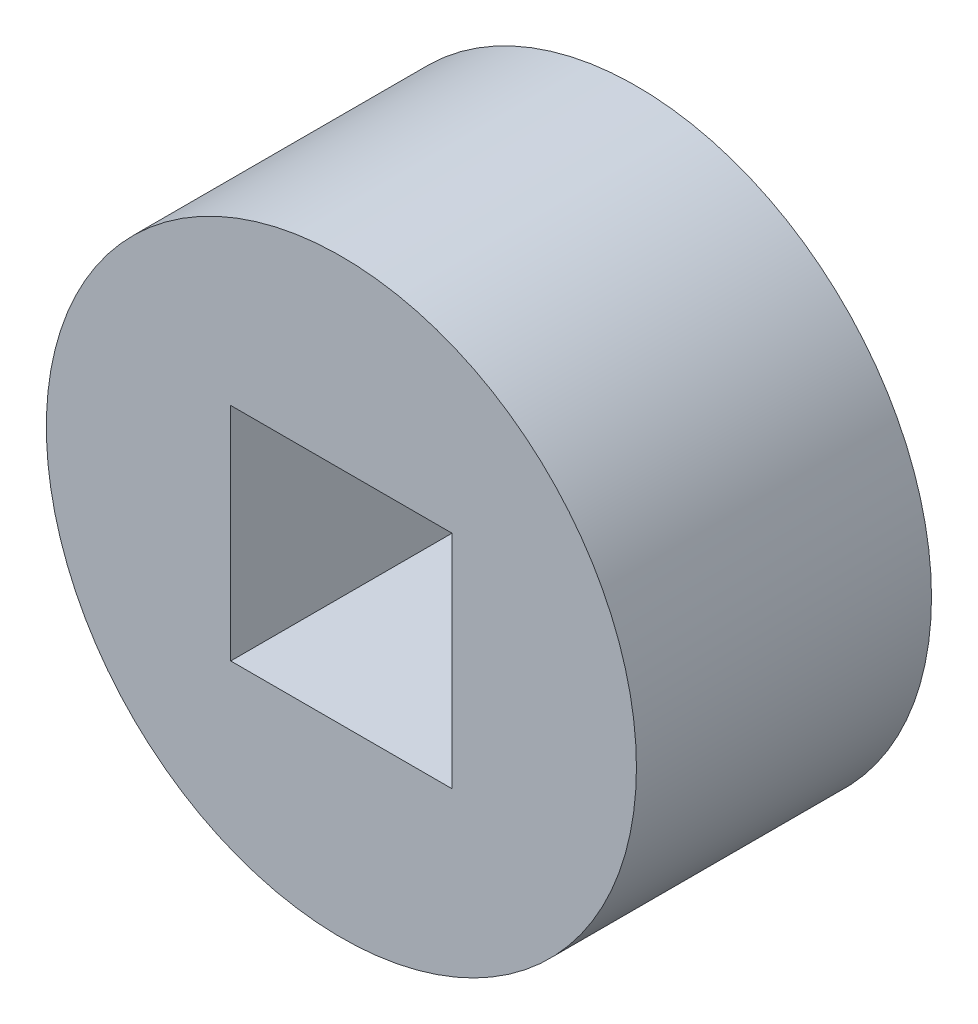
ISO-10303-21;
HEADER;
FILE_DESCRIPTION(('STEP AP214'),'2;1');
FILE_NAME('part.step','',(''),(''),'','','');
FILE_SCHEMA(('AUTOMOTIVE_DESIGN { 1 0 10303 214 1 1 1 1 }'));
ENDSEC;
DATA;
#1=APPLICATION_CONTEXT('core data for automotive mechanical design processes');
#2=APPLICATION_PROTOCOL_DEFINITION('international standard','automotive_design',2000,#1);
#3=PRODUCT_CONTEXT('',#1,'mechanical');
#4=PRODUCT('Part','Part','',(#3));
#5=PRODUCT_RELATED_PRODUCT_CATEGORY('part','',(#4));
#6=PRODUCT_DEFINITION_FORMATION('','',#4);
#7=PRODUCT_DEFINITION_CONTEXT('part definition',#1,'design');
#8=PRODUCT_DEFINITION('design','',#6,#7);
#9=PRODUCT_DEFINITION_SHAPE('','',#8);
#10=(LENGTH_UNIT() NAMED_UNIT(*) SI_UNIT(.MILLI.,.METRE.));
#11=(NAMED_UNIT(*) PLANE_ANGLE_UNIT() SI_UNIT($,.RADIAN.));
#12=(NAMED_UNIT(*) SI_UNIT($,.STERADIAN.) SOLID_ANGLE_UNIT());
#13=UNCERTAINTY_MEASURE_WITH_UNIT(LENGTH_MEASURE(1.E-05),#10,'distance_accuracy_value','');
#14=(GEOMETRIC_REPRESENTATION_CONTEXT(3) GLOBAL_UNCERTAINTY_ASSIGNED_CONTEXT((#13)) GLOBAL_UNIT_ASSIGNED_CONTEXT((#10,
#11,#12)) REPRESENTATION_CONTEXT('',''));
#15=CARTESIAN_POINT('',(0.,0.,0.));
#16=DIRECTION('',(0.,0.,1.));
#17=DIRECTION('',(1.,0.,0.));
#18=AXIS2_PLACEMENT_3D('',#15,#16,#17);
#19=CARTESIAN_POINT('',(0.,0.,4.));
#20=DIRECTION('',(0.,0.,1.));
#21=DIRECTION('',(1.,0.,0.));
#22=AXIS2_PLACEMENT_3D('',#19,#20,#21);
#23=PLANE('',#22);
#24=CARTESIAN_POINT('',(0.,0.,4.));
#25=DIRECTION('',(0.,0.,1.));
#26=DIRECTION('',(1.,0.,0.));
#27=AXIS2_PLACEMENT_3D('',#24,#25,#26);
#28=CIRCLE('',#27,4.);
#29=CARTESIAN_POINT('',(4.,0.,4.));
#30=VERTEX_POINT('',#29);
#31=EDGE_CURVE('E11',#30,#30,#28,.T.);
#32=ORIENTED_EDGE('',*,*,#31,.T.);
#33=EDGE_LOOP('',(#32));
#34=FACE_BOUND('',#33,.T.);
#35=DIRECTION('',(-1.,0.,0.));
#36=VECTOR('',#35,1.);
#37=CARTESIAN_POINT('',(-1.5,1.5,4.));
#38=LINE('',#37,#36);
#39=CARTESIAN_POINT('',(1.5,1.5,4.));
#40=VERTEX_POINT('',#39);
#41=CARTESIAN_POINT('',(-1.5,1.5,4.));
#42=VERTEX_POINT('',#41);
#43=EDGE_CURVE('E84',#40,#42,#38,.T.);
#44=ORIENTED_EDGE('',*,*,#43,.F.);
#45=DIRECTION('',(0.,1.,0.));
#46=VECTOR('',#45,1.);
#47=CARTESIAN_POINT('',(1.5,-1.5,4.));
#48=LINE('',#47,#46);
#49=CARTESIAN_POINT('',(1.5,-1.5,4.));
#50=VERTEX_POINT('',#49);
#51=EDGE_CURVE('E76',#50,#40,#48,.T.);
#52=ORIENTED_EDGE('',*,*,#51,.F.);
#53=DIRECTION('',(1.,0.,0.));
#54=VECTOR('',#53,1.);
#55=CARTESIAN_POINT('',(-1.5,-1.5,4.));
#56=LINE('',#55,#54);
#57=CARTESIAN_POINT('',(-1.5,-1.5,4.));
#58=VERTEX_POINT('',#57);
#59=EDGE_CURVE('E97',#58,#50,#56,.T.);
#60=ORIENTED_EDGE('',*,*,#59,.F.);
#61=DIRECTION('',(0.,-1.,0.));
#62=VECTOR('',#61,1.);
#63=CARTESIAN_POINT('',(-1.5,-1.5,4.));
#64=LINE('',#63,#62);
#65=EDGE_CURVE('E95',#42,#58,#64,.T.);
#66=ORIENTED_EDGE('',*,*,#65,.F.);
#67=EDGE_LOOP('',(#44,#52,#60,#66));
#68=FACE_BOUND('',#67,.T.);
#69=ADVANCED_FACE('F35',(#34,#68),#23,.T.);
#70=CARTESIAN_POINT('',(0.,0.,0.));
#71=DIRECTION('',(0.,0.,1.));
#72=DIRECTION('',(1.,0.,0.));
#73=AXIS2_PLACEMENT_3D('',#70,#71,#72);
#74=PLANE('',#73);
#75=CARTESIAN_POINT('',(0.,0.,0.));
#76=DIRECTION('',(0.,0.,1.));
#77=DIRECTION('',(1.,0.,0.));
#78=AXIS2_PLACEMENT_3D('',#75,#76,#77);
#79=CIRCLE('',#78,4.);
#80=CARTESIAN_POINT('',(4.,0.,0.));
#81=VERTEX_POINT('',#80);
#82=EDGE_CURVE('E39',#81,#81,#79,.T.);
#83=ORIENTED_EDGE('',*,*,#82,.F.);
#84=EDGE_LOOP('',(#83));
#85=FACE_BOUND('',#84,.T.);
#86=DIRECTION('',(0.,1.,0.));
#87=VECTOR('',#86,1.);
#88=CARTESIAN_POINT('',(1.5,-1.5,0.));
#89=LINE('',#88,#87);
#90=CARTESIAN_POINT('',(1.5,-1.5,0.));
#91=VERTEX_POINT('',#90);
#92=CARTESIAN_POINT('',(1.5,1.5,0.));
#93=VERTEX_POINT('',#92);
#94=EDGE_CURVE('E58',#91,#93,#89,.T.);
#95=ORIENTED_EDGE('',*,*,#94,.T.);
#96=DIRECTION('',(-1.,0.,0.));
#97=VECTOR('',#96,1.);
#98=CARTESIAN_POINT('',(-1.5,1.5,0.));
#99=LINE('',#98,#97);
#100=CARTESIAN_POINT('',(-1.5,1.5,0.));
#101=VERTEX_POINT('',#100);
#102=EDGE_CURVE('E91',#93,#101,#99,.T.);
#103=ORIENTED_EDGE('',*,*,#102,.T.);
#104=DIRECTION('',(0.,-1.,0.));
#105=VECTOR('',#104,1.);
#106=CARTESIAN_POINT('',(-1.5,-1.5,0.));
#107=LINE('',#106,#105);
#108=CARTESIAN_POINT('',(-1.5,-1.5,0.));
#109=VERTEX_POINT('',#108);
#110=EDGE_CURVE('E103',#101,#109,#107,.T.);
#111=ORIENTED_EDGE('',*,*,#110,.T.);
#112=DIRECTION('',(1.,0.,0.));
#113=VECTOR('',#112,1.);
#114=CARTESIAN_POINT('',(-1.5,-1.5,0.));
#115=LINE('',#114,#113);
#116=EDGE_CURVE('E85',#109,#91,#115,.T.);
#117=ORIENTED_EDGE('',*,*,#116,.T.);
#118=EDGE_LOOP('',(#95,#103,#111,#117));
#119=FACE_BOUND('',#118,.T.);
#120=ADVANCED_FACE('F114',(#85,#119),#74,.F.);
#121=CARTESIAN_POINT('',(0.,0.,4.));
#122=DIRECTION('',(0.,0.,-1.));
#123=DIRECTION('',(-1.,0.,0.));
#124=AXIS2_PLACEMENT_3D('',#121,#122,#123);
#125=CYLINDRICAL_SURFACE('',#124,4.);
#126=ORIENTED_EDGE('',*,*,#31,.F.);
#127=EDGE_LOOP('',(#126));
#128=FACE_BOUND('',#127,.T.);
#129=ORIENTED_EDGE('',*,*,#82,.T.);
#130=EDGE_LOOP('',(#129));
#131=FACE_BOUND('',#130,.T.);
#132=ADVANCED_FACE('F37',(#128,#131),#125,.T.);
#133=CARTESIAN_POINT('',(1.5,-1.5,4.));
#134=DIRECTION('',(-1.,0.,0.));
#135=DIRECTION('',(0.,0.,1.));
#136=AXIS2_PLACEMENT_3D('',#133,#134,#135);
#137=PLANE('',#136);
#138=ORIENTED_EDGE('',*,*,#94,.F.);
#139=DIRECTION('',(0.,0.,-1.));
#140=VECTOR('',#139,1.);
#141=CARTESIAN_POINT('',(1.5,-1.5,4.));
#142=LINE('',#141,#140);
#143=EDGE_CURVE('E80',#50,#91,#142,.T.);
#144=ORIENTED_EDGE('',*,*,#143,.F.);
#145=ORIENTED_EDGE('',*,*,#51,.T.);
#146=DIRECTION('',(0.,0.,-1.));
#147=VECTOR('',#146,1.);
#148=CARTESIAN_POINT('',(1.5,1.5,4.));
#149=LINE('',#148,#147);
#150=EDGE_CURVE('E79',#40,#93,#149,.T.);
#151=ORIENTED_EDGE('',*,*,#150,.T.);
#152=EDGE_LOOP('',(#138,#144,#145,#151));
#153=FACE_BOUND('',#152,.T.);
#154=ADVANCED_FACE('F78',(#153),#137,.T.);
#155=CARTESIAN_POINT('',(-1.5,1.5,4.));
#156=DIRECTION('',(0.,-1.,0.));
#157=DIRECTION('',(0.,0.,-1.));
#158=AXIS2_PLACEMENT_3D('',#155,#156,#157);
#159=PLANE('',#158);
#160=ORIENTED_EDGE('',*,*,#102,.F.);
#161=ORIENTED_EDGE('',*,*,#150,.F.);
#162=ORIENTED_EDGE('',*,*,#43,.T.);
#163=DIRECTION('',(0.,0.,-1.));
#164=VECTOR('',#163,1.);
#165=CARTESIAN_POINT('',(-1.5,1.5,4.));
#166=LINE('',#165,#164);
#167=EDGE_CURVE('E92',#42,#101,#166,.T.);
#168=ORIENTED_EDGE('',*,*,#167,.T.);
#169=EDGE_LOOP('',(#160,#161,#162,#168));
#170=FACE_BOUND('',#169,.T.);
#171=ADVANCED_FACE('F88',(#170),#159,.T.);
#172=CARTESIAN_POINT('',(-1.5,-1.5,4.));
#173=DIRECTION('',(1.,0.,0.));
#174=DIRECTION('',(0.,0.,-1.));
#175=AXIS2_PLACEMENT_3D('',#172,#173,#174);
#176=PLANE('',#175);
#177=ORIENTED_EDGE('',*,*,#110,.F.);
#178=ORIENTED_EDGE('',*,*,#167,.F.);
#179=ORIENTED_EDGE('',*,*,#65,.T.);
#180=DIRECTION('',(0.,0.,-1.));
#181=VECTOR('',#180,1.);
#182=CARTESIAN_POINT('',(-1.5,-1.5,4.));
#183=LINE('',#182,#181);
#184=EDGE_CURVE('E50',#58,#109,#183,.T.);
#185=ORIENTED_EDGE('',*,*,#184,.T.);
#186=EDGE_LOOP('',(#177,#178,#179,#185));
#187=FACE_BOUND('',#186,.T.);
#188=ADVANCED_FACE('F112',(#187),#176,.T.);
#189=CARTESIAN_POINT('',(-1.5,-1.5,4.));
#190=DIRECTION('',(0.,1.,0.));
#191=DIRECTION('',(0.,0.,1.));
#192=AXIS2_PLACEMENT_3D('',#189,#190,#191);
#193=PLANE('',#192);
#194=ORIENTED_EDGE('',*,*,#116,.F.);
#195=ORIENTED_EDGE('',*,*,#184,.F.);
#196=ORIENTED_EDGE('',*,*,#59,.T.);
#197=ORIENTED_EDGE('',*,*,#143,.T.);
#198=EDGE_LOOP('',(#194,#195,#196,#197));
#199=FACE_BOUND('',#198,.T.);
#200=ADVANCED_FACE('F115',(#199),#193,.T.);
#201=CLOSED_SHELL('',(#69,#120,#132,#154,#171,#188,#200));
#202=MANIFOLD_SOLID_BREP('B2',#201);
#203=ADVANCED_BREP_SHAPE_REPRESENTATION('',(#18,#202),#14);
#204=SHAPE_DEFINITION_REPRESENTATION(#9,#203);
ENDSEC;
END-ISO-10303-21;
